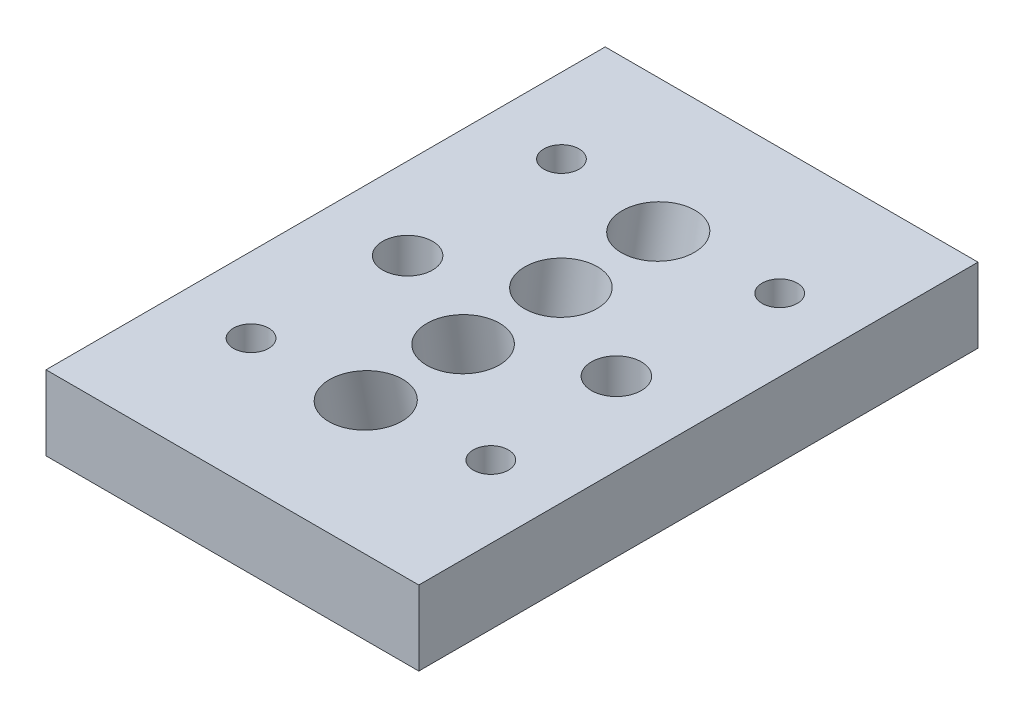
ISO-10303-21;
HEADER;
FILE_DESCRIPTION(('STEP AP214'),'2;1');
FILE_NAME('part.step','',(''),(''),'','','');
FILE_SCHEMA(('AUTOMOTIVE_DESIGN { 1 0 10303 214 1 1 1 1 }'));
ENDSEC;
DATA;
#1=APPLICATION_CONTEXT('core data for automotive mechanical design processes');
#2=APPLICATION_PROTOCOL_DEFINITION('international standard','automotive_design',2000,#1);
#3=PRODUCT_CONTEXT('',#1,'mechanical');
#4=PRODUCT('Part','Part','',(#3));
#5=PRODUCT_RELATED_PRODUCT_CATEGORY('part','',(#4));
#6=PRODUCT_DEFINITION_FORMATION('','',#4);
#7=PRODUCT_DEFINITION_CONTEXT('part definition',#1,'design');
#8=PRODUCT_DEFINITION('design','',#6,#7);
#9=PRODUCT_DEFINITION_SHAPE('','',#8);
#10=(LENGTH_UNIT() NAMED_UNIT(*) SI_UNIT(.MILLI.,.METRE.));
#11=(NAMED_UNIT(*) PLANE_ANGLE_UNIT() SI_UNIT($,.RADIAN.));
#12=(NAMED_UNIT(*) SI_UNIT($,.STERADIAN.) SOLID_ANGLE_UNIT());
#13=UNCERTAINTY_MEASURE_WITH_UNIT(LENGTH_MEASURE(1.E-05),#10,'distance_accuracy_value','');
#14=(GEOMETRIC_REPRESENTATION_CONTEXT(3) GLOBAL_UNCERTAINTY_ASSIGNED_CONTEXT((#13)) GLOBAL_UNIT_ASSIGNED_CONTEXT((#10,
#11,#12)) REPRESENTATION_CONTEXT('',''));
#15=CARTESIAN_POINT('',(0.,0.,0.));
#16=DIRECTION('',(0.,0.,1.));
#17=DIRECTION('',(1.,0.,0.));
#18=AXIS2_PLACEMENT_3D('',#15,#16,#17);
#19=CARTESIAN_POINT('',(0.,5.08,0.));
#20=DIRECTION('',(0.,1.,0.));
#21=DIRECTION('',(0.,0.,1.));
#22=AXIS2_PLACEMENT_3D('',#19,#20,#21);
#23=PLANE('',#22);
#24=CARTESIAN_POINT('',(7.7796540491516,5.08,9.22186476044828));
#25=DIRECTION('',(0.,1.,0.));
#26=DIRECTION('',(0.,0.,1.));
#27=AXIS2_PLACEMENT_3D('',#24,#25,#26);
#28=CIRCLE('',#27,1.19999999999999);
#29=CARTESIAN_POINT('',(7.7796540491516,5.08,10.4218647604483));
#30=VERTEX_POINT('',#29);
#31=EDGE_CURVE('E149',#30,#30,#28,.T.);
#32=ORIENTED_EDGE('',*,*,#31,.F.);
#33=EDGE_LOOP('',(#32));
#34=FACE_BOUND('',#33,.T.);
#35=CARTESIAN_POINT('',(7.7796540491516,5.08,-10.4576477241523));
#36=DIRECTION('',(0.,1.,0.));
#37=DIRECTION('',(0.,0.,1.));
#38=AXIS2_PLACEMENT_3D('',#35,#36,#37);
#39=CIRCLE('',#38,1.19999999999999);
#40=CARTESIAN_POINT('',(7.7796540491516,5.08,-9.25764772415226));
#41=VERTEX_POINT('',#40);
#42=EDGE_CURVE('E138',#41,#41,#39,.T.);
#43=ORIENTED_EDGE('',*,*,#42,.F.);
#44=EDGE_LOOP('',(#43));
#45=FACE_BOUND('',#44,.T.);
#46=CARTESIAN_POINT('',(-7.57325747651194,5.08,10.2052037424585));
#47=DIRECTION('',(0.,1.,0.));
#48=DIRECTION('',(0.,0.,1.));
#49=AXIS2_PLACEMENT_3D('',#46,#47,#48);
#50=CIRCLE('',#49,1.2);
#51=CARTESIAN_POINT('',(-7.57325747651194,5.08,11.4052037424585));
#52=VERTEX_POINT('',#51);
#53=EDGE_CURVE('E137',#52,#52,#50,.T.);
#54=ORIENTED_EDGE('',*,*,#53,.F.);
#55=EDGE_LOOP('',(#54));
#56=FACE_BOUND('',#55,.T.);
#57=CARTESIAN_POINT('',(-7.57325747651194,5.08,-10.9429439366693));
#58=DIRECTION('',(0.,1.,0.));
#59=DIRECTION('',(0.,0.,1.));
#60=AXIS2_PLACEMENT_3D('',#57,#58,#59);
#61=CIRCLE('',#60,1.2);
#62=CARTESIAN_POINT('',(-7.57325747651194,5.08,-9.74294393666928));
#63=VERTEX_POINT('',#62);
#64=EDGE_CURVE('E134',#63,#63,#61,.T.);
#65=ORIENTED_EDGE('',*,*,#64,.F.);
#66=EDGE_LOOP('',(#65));
#67=FACE_BOUND('',#66,.T.);
#68=CARTESIAN_POINT('',(7.112,5.08,0.));
#69=DIRECTION('',(0.,1.,0.));
#70=DIRECTION('',(0.,0.,1.));
#71=AXIS2_PLACEMENT_3D('',#68,#69,#70);
#72=CIRCLE('',#71,1.69999999999999);
#73=CARTESIAN_POINT('',(7.112,5.08,1.69999999999999));
#74=VERTEX_POINT('',#73);
#75=EDGE_CURVE('E131',#74,#74,#72,.T.);
#76=ORIENTED_EDGE('',*,*,#75,.F.);
#77=EDGE_LOOP('',(#76));
#78=FACE_BOUND('',#77,.T.);
#79=CARTESIAN_POINT('',(-7.112,5.08,0.));
#80=DIRECTION('',(0.,1.,0.));
#81=DIRECTION('',(0.,0.,1.));
#82=AXIS2_PLACEMENT_3D('',#79,#80,#81);
#83=CIRCLE('',#82,1.69999999999999);
#84=CARTESIAN_POINT('',(-7.112,5.08,1.69999999999999));
#85=VERTEX_POINT('',#84);
#86=EDGE_CURVE('E127',#85,#85,#83,.T.);
#87=ORIENTED_EDGE('',*,*,#86,.F.);
#88=EDGE_LOOP('',(#87));
#89=FACE_BOUND('',#88,.T.);
#90=CARTESIAN_POINT('',(0.,5.08,3.33247001733381));
#91=DIRECTION('',(0.,1.,0.));
#92=DIRECTION('',(0.,0.,1.));
#93=AXIS2_PLACEMENT_3D('',#90,#91,#92);
#94=ELLIPSE('',#93,2.48230270796551,2.4638);
#95=CARTESIAN_POINT('',(0.,5.08,5.81477272529932));
#96=VERTEX_POINT('',#95);
#97=EDGE_CURVE('E103',#96,#96,#94,.F.);
#98=ORIENTED_EDGE('',*,*,#97,.T.);
#99=EDGE_LOOP('',(#98));
#100=FACE_BOUND('',#99,.T.);
#101=DIRECTION('',(0.,0.,1.));
#102=VECTOR('',#101,1.);
#103=CARTESIAN_POINT('',(-12.7,5.08,19.05));
#104=LINE('',#103,#102);
#105=CARTESIAN_POINT('',(-12.7,5.08,-19.05));
#106=VERTEX_POINT('',#105);
#107=CARTESIAN_POINT('',(-12.7,5.08,19.05));
#108=VERTEX_POINT('',#107);
#109=EDGE_CURVE('E87',#106,#108,#104,.T.);
#110=ORIENTED_EDGE('',*,*,#109,.T.);
#111=DIRECTION('',(1.,0.,0.));
#112=VECTOR('',#111,1.);
#113=CARTESIAN_POINT('',(12.7,5.08,19.05));
#114=LINE('',#113,#112);
#115=CARTESIAN_POINT('',(12.7,5.08,19.05));
#116=VERTEX_POINT('',#115);
#117=EDGE_CURVE('E82',#108,#116,#114,.T.);
#118=ORIENTED_EDGE('',*,*,#117,.T.);
#119=DIRECTION('',(0.,0.,-1.));
#120=VECTOR('',#119,1.);
#121=CARTESIAN_POINT('',(12.7,5.08,19.05));
#122=LINE('',#121,#120);
#123=CARTESIAN_POINT('',(12.7,5.08,-19.05));
#124=VERTEX_POINT('',#123);
#125=EDGE_CURVE('E85',#116,#124,#122,.T.);
#126=ORIENTED_EDGE('',*,*,#125,.T.);
#127=DIRECTION('',(-1.,0.,0.));
#128=VECTOR('',#127,1.);
#129=CARTESIAN_POINT('',(12.7,5.08,-19.05));
#130=LINE('',#129,#128);
#131=EDGE_CURVE('E52',#124,#106,#130,.T.);
#132=ORIENTED_EDGE('',*,*,#131,.T.);
#133=EDGE_LOOP('',(#110,#118,#126,#132));
#134=FACE_BOUND('',#133,.T.);
#135=CARTESIAN_POINT('',(0.,5.08,9.96477497598041));
#136=DIRECTION('',(0.,1.,0.));
#137=DIRECTION('',(0.,0.,1.));
#138=AXIS2_PLACEMENT_3D('',#135,#136,#137);
#139=ELLIPSE('',#138,2.50868272774917,2.4638);
#140=CARTESIAN_POINT('',(0.,5.08,12.4734577037296));
#141=VERTEX_POINT('',#140);
#142=EDGE_CURVE('E112',#141,#141,#139,.T.);
#143=ORIENTED_EDGE('',*,*,#142,.F.);
#144=EDGE_LOOP('',(#143));
#145=FACE_BOUND('',#144,.T.);
#146=CARTESIAN_POINT('',(0.,5.08,-3.33247001733381));
#147=DIRECTION('',(0.,1.,0.));
#148=DIRECTION('',(0.,0.,-1.));
#149=AXIS2_PLACEMENT_3D('',#146,#147,#148);
#150=ELLIPSE('',#149,2.48230270796551,2.4638);
#151=CARTESIAN_POINT('',(0.,5.08,-5.81477272529932));
#152=VERTEX_POINT('',#151);
#153=EDGE_CURVE('E116',#152,#152,#150,.T.);
#154=ORIENTED_EDGE('',*,*,#153,.F.);
#155=EDGE_LOOP('',(#154));
#156=FACE_BOUND('',#155,.T.);
#157=CARTESIAN_POINT('',(0.,5.08,-9.96477497598041));
#158=DIRECTION('',(0.,1.,0.));
#159=DIRECTION('',(0.,0.,-1.));
#160=AXIS2_PLACEMENT_3D('',#157,#158,#159);
#161=ELLIPSE('',#160,2.50868272774917,2.4638);
#162=CARTESIAN_POINT('',(0.,5.08,-12.4734577037296));
#163=VERTEX_POINT('',#162);
#164=EDGE_CURVE('E120',#163,#163,#161,.F.);
#165=ORIENTED_EDGE('',*,*,#164,.T.);
#166=EDGE_LOOP('',(#165));
#167=FACE_BOUND('',#166,.T.);
#168=ADVANCED_FACE('F33',(#34,#45,#56,#67,#78,#89,#100,#134,#145,#156,#167),#23,.T.);
#169=CARTESIAN_POINT('',(0.,0.,0.));
#170=DIRECTION('',(0.,1.,0.));
#171=DIRECTION('',(0.,0.,1.));
#172=AXIS2_PLACEMENT_3D('',#169,#170,#171);
#173=PLANE('',#172);
#174=CARTESIAN_POINT('',(7.7796540491516,0.,9.22186476044828));
#175=DIRECTION('',(0.,1.,0.));
#176=DIRECTION('',(0.,0.,1.));
#177=AXIS2_PLACEMENT_3D('',#174,#175,#176);
#178=CIRCLE('',#177,1.19999999999999);
#179=CARTESIAN_POINT('',(7.7796540491516,0.,10.4218647604483));
#180=VERTEX_POINT('',#179);
#181=EDGE_CURVE('E37',#180,#180,#178,.T.);
#182=ORIENTED_EDGE('',*,*,#181,.T.);
#183=EDGE_LOOP('',(#182));
#184=FACE_BOUND('',#183,.T.);
#185=CARTESIAN_POINT('',(7.7796540491516,0.,-10.4576477241523));
#186=DIRECTION('',(0.,1.,0.));
#187=DIRECTION('',(0.,0.,1.));
#188=AXIS2_PLACEMENT_3D('',#185,#186,#187);
#189=CIRCLE('',#188,1.19999999999999);
#190=CARTESIAN_POINT('',(7.7796540491516,0.,-9.25764772415227));
#191=VERTEX_POINT('',#190);
#192=EDGE_CURVE('E135',#191,#191,#189,.T.);
#193=ORIENTED_EDGE('',*,*,#192,.T.);
#194=EDGE_LOOP('',(#193));
#195=FACE_BOUND('',#194,.T.);
#196=CARTESIAN_POINT('',(-7.57325747651194,0.,10.2052037424585));
#197=DIRECTION('',(0.,1.,0.));
#198=DIRECTION('',(0.,0.,1.));
#199=AXIS2_PLACEMENT_3D('',#196,#197,#198);
#200=CIRCLE('',#199,1.19999999999999);
#201=CARTESIAN_POINT('',(-7.57325747651194,0.,11.4052037424585));
#202=VERTEX_POINT('',#201);
#203=EDGE_CURVE('E142',#202,#202,#200,.T.);
#204=ORIENTED_EDGE('',*,*,#203,.T.);
#205=EDGE_LOOP('',(#204));
#206=FACE_BOUND('',#205,.T.);
#207=CARTESIAN_POINT('',(-7.57325747651194,0.,-10.9429439366693));
#208=DIRECTION('',(0.,1.,0.));
#209=DIRECTION('',(0.,0.,1.));
#210=AXIS2_PLACEMENT_3D('',#207,#208,#209);
#211=CIRCLE('',#210,1.19999999999999);
#212=CARTESIAN_POINT('',(-7.57325747651194,0.,-9.74294393666929));
#213=VERTEX_POINT('',#212);
#214=EDGE_CURVE('E132',#213,#213,#211,.T.);
#215=ORIENTED_EDGE('',*,*,#214,.T.);
#216=EDGE_LOOP('',(#215));
#217=FACE_BOUND('',#216,.T.);
#218=CARTESIAN_POINT('',(7.112,0.,0.));
#219=DIRECTION('',(0.,1.,0.));
#220=DIRECTION('',(0.,0.,1.));
#221=AXIS2_PLACEMENT_3D('',#218,#219,#220);
#222=CIRCLE('',#221,1.69999999999999);
#223=CARTESIAN_POINT('',(7.112,0.,1.69999999999999));
#224=VERTEX_POINT('',#223);
#225=EDGE_CURVE('E128',#224,#224,#222,.T.);
#226=ORIENTED_EDGE('',*,*,#225,.T.);
#227=EDGE_LOOP('',(#226));
#228=FACE_BOUND('',#227,.T.);
#229=CARTESIAN_POINT('',(-7.112,0.,0.));
#230=DIRECTION('',(0.,1.,0.));
#231=DIRECTION('',(0.,0.,1.));
#232=AXIS2_PLACEMENT_3D('',#229,#230,#231);
#233=CIRCLE('',#232,1.69999999999999);
#234=CARTESIAN_POINT('',(-7.112,0.,1.69999999999999));
#235=VERTEX_POINT('',#234);
#236=EDGE_CURVE('E124',#235,#235,#233,.T.);
#237=ORIENTED_EDGE('',*,*,#236,.T.);
#238=EDGE_LOOP('',(#237));
#239=FACE_BOUND('',#238,.T.);
#240=CARTESIAN_POINT('',(0.,0.,2.70872444794709));
#241=DIRECTION('',(0.,1.,0.));
#242=DIRECTION('',(0.,0.,1.));
#243=AXIS2_PLACEMENT_3D('',#240,#241,#242);
#244=ELLIPSE('',#243,2.48230270796551,2.4638);
#245=CARTESIAN_POINT('',(0.,0.,5.1910271559126));
#246=VERTEX_POINT('',#245);
#247=EDGE_CURVE('E109',#246,#246,#244,.F.);
#248=ORIENTED_EDGE('',*,*,#247,.F.);
#249=EDGE_LOOP('',(#248));
#250=FACE_BOUND('',#249,.T.);
#251=DIRECTION('',(0.,0.,1.));
#252=VECTOR('',#251,1.);
#253=CARTESIAN_POINT('',(-12.7,0.,19.05));
#254=LINE('',#253,#252);
#255=CARTESIAN_POINT('',(-12.7,0.,-19.05));
#256=VERTEX_POINT('',#255);
#257=CARTESIAN_POINT('',(-12.7,0.,19.05));
#258=VERTEX_POINT('',#257);
#259=EDGE_CURVE('E100',#256,#258,#254,.T.);
#260=ORIENTED_EDGE('',*,*,#259,.F.);
#261=DIRECTION('',(-1.,0.,0.));
#262=VECTOR('',#261,1.);
#263=CARTESIAN_POINT('',(12.7,0.,-19.05));
#264=LINE('',#263,#262);
#265=CARTESIAN_POINT('',(12.7,0.,-19.05));
#266=VERTEX_POINT('',#265);
#267=EDGE_CURVE('E75',#266,#256,#264,.T.);
#268=ORIENTED_EDGE('',*,*,#267,.F.);
#269=DIRECTION('',(0.,0.,-1.));
#270=VECTOR('',#269,1.);
#271=CARTESIAN_POINT('',(12.7,0.,19.05));
#272=LINE('',#271,#270);
#273=CARTESIAN_POINT('',(12.7,0.,19.05));
#274=VERTEX_POINT('',#273);
#275=EDGE_CURVE('E69',#274,#266,#272,.T.);
#276=ORIENTED_EDGE('',*,*,#275,.F.);
#277=DIRECTION('',(1.,0.,0.));
#278=VECTOR('',#277,1.);
#279=CARTESIAN_POINT('',(12.7,0.,19.05));
#280=LINE('',#279,#278);
#281=EDGE_CURVE('E91',#258,#274,#280,.T.);
#282=ORIENTED_EDGE('',*,*,#281,.F.);
#283=EDGE_LOOP('',(#260,#268,#276,#282));
#284=FACE_BOUND('',#283,.T.);
#285=CARTESIAN_POINT('',(0.,0.,8.99071763293331));
#286=DIRECTION('',(0.,1.,0.));
#287=DIRECTION('',(0.,0.,1.));
#288=AXIS2_PLACEMENT_3D('',#285,#286,#287);
#289=ELLIPSE('',#288,2.50868272774917,2.4638);
#290=CARTESIAN_POINT('',(0.,0.,11.4994003606825));
#291=VERTEX_POINT('',#290);
#292=EDGE_CURVE('E113',#291,#291,#289,.T.);
#293=ORIENTED_EDGE('',*,*,#292,.T.);
#294=EDGE_LOOP('',(#293));
#295=FACE_BOUND('',#294,.T.);
#296=CARTESIAN_POINT('',(0.,0.,-2.70872444794709));
#297=DIRECTION('',(0.,1.,0.));
#298=DIRECTION('',(0.,0.,-1.));
#299=AXIS2_PLACEMENT_3D('',#296,#297,#298);
#300=ELLIPSE('',#299,2.48230270796551,2.4638);
#301=CARTESIAN_POINT('',(0.,0.,-5.1910271559126));
#302=VERTEX_POINT('',#301);
#303=EDGE_CURVE('E117',#302,#302,#300,.T.);
#304=ORIENTED_EDGE('',*,*,#303,.T.);
#305=EDGE_LOOP('',(#304));
#306=FACE_BOUND('',#305,.T.);
#307=CARTESIAN_POINT('',(0.,0.,-8.99071763293331));
#308=DIRECTION('',(0.,1.,0.));
#309=DIRECTION('',(0.,0.,-1.));
#310=AXIS2_PLACEMENT_3D('',#307,#308,#309);
#311=ELLIPSE('',#310,2.50868272774917,2.4638);
#312=CARTESIAN_POINT('',(0.,0.,-11.4994003606825));
#313=VERTEX_POINT('',#312);
#314=EDGE_CURVE('E121',#313,#313,#311,.F.);
#315=ORIENTED_EDGE('',*,*,#314,.F.);
#316=EDGE_LOOP('',(#315));
#317=FACE_BOUND('',#316,.T.);
#318=ADVANCED_FACE('F178',(#184,#195,#206,#217,#228,#239,#250,#284,#295,#306,#317),#173,.F.);
#319=CARTESIAN_POINT('',(-12.7,5.08,19.05));
#320=DIRECTION('',(1.,0.,0.));
#321=DIRECTION('',(0.,0.,-1.));
#322=AXIS2_PLACEMENT_3D('',#319,#320,#321);
#323=PLANE('',#322);
#324=ORIENTED_EDGE('',*,*,#259,.T.);
#325=DIRECTION('',(0.,-1.,0.));
#326=VECTOR('',#325,1.);
#327=CARTESIAN_POINT('',(-12.7,5.08,19.05));
#328=LINE('',#327,#326);
#329=EDGE_CURVE('E11',#108,#258,#328,.T.);
#330=ORIENTED_EDGE('',*,*,#329,.F.);
#331=ORIENTED_EDGE('',*,*,#109,.F.);
#332=DIRECTION('',(0.,-1.,0.));
#333=VECTOR('',#332,1.);
#334=CARTESIAN_POINT('',(-12.7,5.08,-19.05));
#335=LINE('',#334,#333);
#336=EDGE_CURVE('E96',#106,#256,#335,.T.);
#337=ORIENTED_EDGE('',*,*,#336,.T.);
#338=EDGE_LOOP('',(#324,#330,#331,#337));
#339=FACE_BOUND('',#338,.T.);
#340=ADVANCED_FACE('F35',(#339),#323,.F.);
#341=CARTESIAN_POINT('',(12.7,5.08,19.05));
#342=DIRECTION('',(0.,0.,-1.));
#343=DIRECTION('',(-1.,0.,0.));
#344=AXIS2_PLACEMENT_3D('',#341,#342,#343);
#345=PLANE('',#344);
#346=ORIENTED_EDGE('',*,*,#281,.T.);
#347=DIRECTION('',(0.,-1.,0.));
#348=VECTOR('',#347,1.);
#349=CARTESIAN_POINT('',(12.7,5.08,19.05));
#350=LINE('',#349,#348);
#351=EDGE_CURVE('E43',#116,#274,#350,.T.);
#352=ORIENTED_EDGE('',*,*,#351,.F.);
#353=ORIENTED_EDGE('',*,*,#117,.F.);
#354=ORIENTED_EDGE('',*,*,#329,.T.);
#355=EDGE_LOOP('',(#346,#352,#353,#354));
#356=FACE_BOUND('',#355,.T.);
#357=ADVANCED_FACE('F90',(#356),#345,.F.);
#358=CARTESIAN_POINT('',(12.7,5.08,19.05));
#359=DIRECTION('',(-1.,0.,0.));
#360=DIRECTION('',(0.,0.,1.));
#361=AXIS2_PLACEMENT_3D('',#358,#359,#360);
#362=PLANE('',#361);
#363=ORIENTED_EDGE('',*,*,#275,.T.);
#364=DIRECTION('',(0.,-1.,0.));
#365=VECTOR('',#364,1.);
#366=CARTESIAN_POINT('',(12.7,5.08,-19.05));
#367=LINE('',#366,#365);
#368=EDGE_CURVE('E92',#124,#266,#367,.T.);
#369=ORIENTED_EDGE('',*,*,#368,.F.);
#370=ORIENTED_EDGE('',*,*,#125,.F.);
#371=ORIENTED_EDGE('',*,*,#351,.T.);
#372=EDGE_LOOP('',(#363,#369,#370,#371));
#373=FACE_BOUND('',#372,.T.);
#374=ADVANCED_FACE('F94',(#373),#362,.F.);
#375=CARTESIAN_POINT('',(12.7,5.08,-19.05));
#376=DIRECTION('',(0.,0.,1.));
#377=DIRECTION('',(1.,0.,0.));
#378=AXIS2_PLACEMENT_3D('',#375,#376,#377);
#379=PLANE('',#378);
#380=ORIENTED_EDGE('',*,*,#267,.T.);
#381=ORIENTED_EDGE('',*,*,#336,.F.);
#382=ORIENTED_EDGE('',*,*,#131,.F.);
#383=ORIENTED_EDGE('',*,*,#368,.T.);
#384=EDGE_LOOP('',(#380,#381,#382,#383));
#385=FACE_BOUND('',#384,.T.);
#386=ADVANCED_FACE('F174',(#385),#379,.F.);
#387=CARTESIAN_POINT('',(0.,-2.63195593213896,2.38556089450363));
#388=DIRECTION('',(0.,0.992546151641323,0.121869343405141));
#389=DIRECTION('',(0.,-0.121869343405141,0.992546151641323));
#390=AXIS2_PLACEMENT_3D('',#387,#388,#389);
#391=CYLINDRICAL_SURFACE('',#390,2.4638);
#392=ORIENTED_EDGE('',*,*,#97,.F.);
#393=EDGE_LOOP('',(#392));
#394=FACE_BOUND('',#393,.T.);
#395=ORIENTED_EDGE('',*,*,#247,.T.);
#396=EDGE_LOOP('',(#395));
#397=FACE_BOUND('',#396,.T.);
#398=ADVANCED_FACE('F170',(#394,#397),#391,.F.);
#399=CARTESIAN_POINT('',(0.,-5.1859623428243,7.99634269183217));
#400=DIRECTION('',(0.,0.982109045814078,0.188313096013423));
#401=DIRECTION('',(0.,-0.188313096013423,0.982109045814078));
#402=AXIS2_PLACEMENT_3D('',#399,#400,#401);
#403=CYLINDRICAL_SURFACE('',#402,2.4638);
#404=ORIENTED_EDGE('',*,*,#142,.T.);
#405=EDGE_LOOP('',(#404));
#406=FACE_BOUND('',#405,.T.);
#407=ORIENTED_EDGE('',*,*,#292,.F.);
#408=EDGE_LOOP('',(#407));
#409=FACE_BOUND('',#408,.T.);
#410=ADVANCED_FACE('F173',(#406,#409),#403,.F.);
#411=CARTESIAN_POINT('',(0.,-2.63195593213896,-2.38556089450363));
#412=DIRECTION('',(0.,0.992546151641323,-0.121869343405141));
#413=DIRECTION('',(0.,0.121869343405141,0.992546151641323));
#414=AXIS2_PLACEMENT_3D('',#411,#412,#413);
#415=CYLINDRICAL_SURFACE('',#414,2.4638);
#416=ORIENTED_EDGE('',*,*,#153,.T.);
#417=EDGE_LOOP('',(#416));
#418=FACE_BOUND('',#417,.T.);
#419=ORIENTED_EDGE('',*,*,#303,.F.);
#420=EDGE_LOOP('',(#419));
#421=FACE_BOUND('',#420,.T.);
#422=ADVANCED_FACE('F194',(#418,#421),#415,.F.);
#423=CARTESIAN_POINT('',(0.,-5.18596234282431,-7.99634269183217));
#424=DIRECTION('',(0.,0.982109045814078,-0.188313096013423));
#425=DIRECTION('',(0.,0.188313096013423,0.982109045814078));
#426=AXIS2_PLACEMENT_3D('',#423,#424,#425);
#427=CYLINDRICAL_SURFACE('',#426,2.4638);
#428=ORIENTED_EDGE('',*,*,#164,.F.);
#429=EDGE_LOOP('',(#428));
#430=FACE_BOUND('',#429,.T.);
#431=ORIENTED_EDGE('',*,*,#314,.T.);
#432=EDGE_LOOP('',(#431));
#433=FACE_BOUND('',#432,.T.);
#434=ADVANCED_FACE('F191',(#430,#433),#427,.F.);
#435=CARTESIAN_POINT('',(-7.112,5.08,0.));
#436=DIRECTION('',(0.,1.,0.));
#437=DIRECTION('',(0.,0.,1.));
#438=AXIS2_PLACEMENT_3D('',#435,#436,#437);
#439=CYLINDRICAL_SURFACE('',#438,1.69999999999999);
#440=ORIENTED_EDGE('',*,*,#86,.T.);
#441=EDGE_LOOP('',(#440));
#442=FACE_BOUND('',#441,.T.);
#443=ORIENTED_EDGE('',*,*,#236,.F.);
#444=EDGE_LOOP('',(#443));
#445=FACE_BOUND('',#444,.T.);
#446=ADVANCED_FACE('F193',(#442,#445),#439,.F.);
#447=CARTESIAN_POINT('',(7.112,5.08,0.));
#448=DIRECTION('',(0.,1.,0.));
#449=DIRECTION('',(0.,0.,1.));
#450=AXIS2_PLACEMENT_3D('',#447,#448,#449);
#451=CYLINDRICAL_SURFACE('',#450,1.69999999999999);
#452=ORIENTED_EDGE('',*,*,#75,.T.);
#453=EDGE_LOOP('',(#452));
#454=FACE_BOUND('',#453,.T.);
#455=ORIENTED_EDGE('',*,*,#225,.F.);
#456=EDGE_LOOP('',(#455));
#457=FACE_BOUND('',#456,.T.);
#458=ADVANCED_FACE('F201',(#454,#457),#451,.F.);
#459=CARTESIAN_POINT('',(-7.57325747651194,5.08,-10.9429439366693));
#460=DIRECTION('',(0.,1.,0.));
#461=DIRECTION('',(0.,0.,1.));
#462=AXIS2_PLACEMENT_3D('',#459,#460,#461);
#463=CYLINDRICAL_SURFACE('',#462,1.19999999999999);
#464=ORIENTED_EDGE('',*,*,#64,.T.);
#465=EDGE_LOOP('',(#464));
#466=FACE_BOUND('',#465,.T.);
#467=ORIENTED_EDGE('',*,*,#214,.F.);
#468=EDGE_LOOP('',(#467));
#469=FACE_BOUND('',#468,.T.);
#470=ADVANCED_FACE('F264',(#466,#469),#463,.F.);
#471=CARTESIAN_POINT('',(-7.57325747651194,5.08,10.2052037424585));
#472=DIRECTION('',(0.,1.,0.));
#473=DIRECTION('',(0.,0.,1.));
#474=AXIS2_PLACEMENT_3D('',#471,#472,#473);
#475=CYLINDRICAL_SURFACE('',#474,1.19999999999999);
#476=ORIENTED_EDGE('',*,*,#53,.T.);
#477=EDGE_LOOP('',(#476));
#478=FACE_BOUND('',#477,.T.);
#479=ORIENTED_EDGE('',*,*,#203,.F.);
#480=EDGE_LOOP('',(#479));
#481=FACE_BOUND('',#480,.T.);
#482=ADVANCED_FACE('F245',(#478,#481),#475,.F.);
#483=CARTESIAN_POINT('',(7.7796540491516,5.08,-10.4576477241523));
#484=DIRECTION('',(0.,1.,0.));
#485=DIRECTION('',(0.,0.,1.));
#486=AXIS2_PLACEMENT_3D('',#483,#484,#485);
#487=CYLINDRICAL_SURFACE('',#486,1.19999999999999);
#488=ORIENTED_EDGE('',*,*,#42,.T.);
#489=EDGE_LOOP('',(#488));
#490=FACE_BOUND('',#489,.T.);
#491=ORIENTED_EDGE('',*,*,#192,.F.);
#492=EDGE_LOOP('',(#491));
#493=FACE_BOUND('',#492,.T.);
#494=ADVANCED_FACE('F239',(#490,#493),#487,.F.);
#495=CARTESIAN_POINT('',(7.7796540491516,5.08,9.22186476044828));
#496=DIRECTION('',(0.,1.,0.));
#497=DIRECTION('',(0.,0.,1.));
#498=AXIS2_PLACEMENT_3D('',#495,#496,#497);
#499=CYLINDRICAL_SURFACE('',#498,1.19999999999999);
#500=ORIENTED_EDGE('',*,*,#31,.T.);
#501=EDGE_LOOP('',(#500));
#502=FACE_BOUND('',#501,.T.);
#503=ORIENTED_EDGE('',*,*,#181,.F.);
#504=EDGE_LOOP('',(#503));
#505=FACE_BOUND('',#504,.T.);
#506=ADVANCED_FACE('F244',(#502,#505),#499,.F.);
#507=CLOSED_SHELL('',(#168,#318,#340,#357,#374,#386,#398,#410,#422,#434,#446,#458,#470,#482,
#494,#506));
#508=MANIFOLD_SOLID_BREP('B2',#507);
#509=ADVANCED_BREP_SHAPE_REPRESENTATION('',(#18,#508),#14);
#510=SHAPE_DEFINITION_REPRESENTATION(#9,#509);
ENDSEC;
END-ISO-10303-21;
